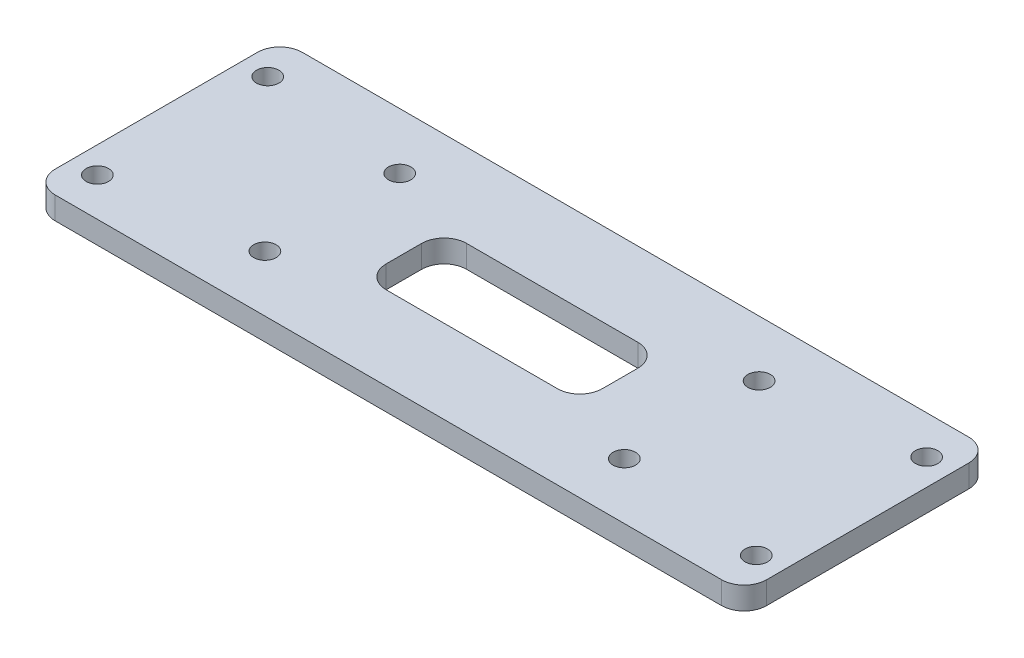
ISO-10303-21;
HEADER;
FILE_DESCRIPTION(('STEP AP214'),'2;1');
FILE_NAME('part.step','',(''),(''),'','','');
FILE_SCHEMA(('AUTOMOTIVE_DESIGN { 1 0 10303 214 1 1 1 1 }'));
ENDSEC;
DATA;
#1=APPLICATION_CONTEXT('core data for automotive mechanical design processes');
#2=APPLICATION_PROTOCOL_DEFINITION('international standard','automotive_design',2000,#1);
#3=PRODUCT_CONTEXT('',#1,'mechanical');
#4=PRODUCT('Part','Part','',(#3));
#5=PRODUCT_RELATED_PRODUCT_CATEGORY('part','',(#4));
#6=PRODUCT_DEFINITION_FORMATION('','',#4);
#7=PRODUCT_DEFINITION_CONTEXT('part definition',#1,'design');
#8=PRODUCT_DEFINITION('design','',#6,#7);
#9=PRODUCT_DEFINITION_SHAPE('','',#8);
#10=(LENGTH_UNIT() NAMED_UNIT(*) SI_UNIT(.MILLI.,.METRE.));
#11=(NAMED_UNIT(*) PLANE_ANGLE_UNIT() SI_UNIT($,.RADIAN.));
#12=(NAMED_UNIT(*) SI_UNIT($,.STERADIAN.) SOLID_ANGLE_UNIT());
#13=UNCERTAINTY_MEASURE_WITH_UNIT(LENGTH_MEASURE(1.E-05),#10,'distance_accuracy_value','');
#14=(GEOMETRIC_REPRESENTATION_CONTEXT(3) GLOBAL_UNCERTAINTY_ASSIGNED_CONTEXT((#13)) GLOBAL_UNIT_ASSIGNED_CONTEXT((#10,
#11,#12)) REPRESENTATION_CONTEXT('',''));
#15=CARTESIAN_POINT('',(0.,0.,0.));
#16=DIRECTION('',(0.,0.,1.));
#17=DIRECTION('',(1.,0.,0.));
#18=AXIS2_PLACEMENT_3D('',#15,#16,#17);
#19=CARTESIAN_POINT('',(-47.5,3.,16.5));
#20=DIRECTION('',(1.,0.,0.));
#21=DIRECTION('',(0.,0.,-1.));
#22=AXIS2_PLACEMENT_3D('',#19,#20,#21);
#23=PLANE('',#22);
#24=DIRECTION('',(0.,0.,1.));
#25=VECTOR('',#24,1.);
#26=CARTESIAN_POINT('',(-47.5,0.,16.5));
#27=LINE('',#26,#25);
#28=CARTESIAN_POINT('',(-47.5,0.,-13.5));
#29=VERTEX_POINT('',#28);
#30=CARTESIAN_POINT('',(-47.5,0.,13.5));
#31=VERTEX_POINT('',#30);
#32=EDGE_CURVE('E322',#29,#31,#27,.T.);
#33=ORIENTED_EDGE('',*,*,#32,.T.);
#34=DIRECTION('',(0.,-1.,0.));
#35=VECTOR('',#34,1.);
#36=CARTESIAN_POINT('',(-47.5,3.,13.5));
#37=LINE('',#36,#35);
#38=CARTESIAN_POINT('',(-47.5,3.,13.5));
#39=VERTEX_POINT('',#38);
#40=EDGE_CURVE('E208',#31,#39,#37,.F.);
#41=ORIENTED_EDGE('',*,*,#40,.T.);
#42=DIRECTION('',(0.,0.,1.));
#43=VECTOR('',#42,1.);
#44=CARTESIAN_POINT('',(-47.5,3.,16.5));
#45=LINE('',#44,#43);
#46=CARTESIAN_POINT('',(-47.5,3.,-13.5));
#47=VERTEX_POINT('',#46);
#48=EDGE_CURVE('E174',#47,#39,#45,.T.);
#49=ORIENTED_EDGE('',*,*,#48,.F.);
#50=DIRECTION('',(0.,-1.,0.));
#51=VECTOR('',#50,1.);
#52=CARTESIAN_POINT('',(-47.5,3.,-13.5));
#53=LINE('',#52,#51);
#54=EDGE_CURVE('E205',#47,#29,#53,.T.);
#55=ORIENTED_EDGE('',*,*,#54,.T.);
#56=EDGE_LOOP('',(#33,#41,#49,#55));
#57=FACE_BOUND('',#56,.T.);
#58=ADVANCED_FACE('F35',(#57),#23,.F.);
#59=CARTESIAN_POINT('',(47.5,3.,16.5));
#60=DIRECTION('',(0.,0.,-1.));
#61=DIRECTION('',(-1.,0.,0.));
#62=AXIS2_PLACEMENT_3D('',#59,#60,#61);
#63=PLANE('',#62);
#64=DIRECTION('',(1.,0.,0.));
#65=VECTOR('',#64,1.);
#66=CARTESIAN_POINT('',(47.5,0.,16.5));
#67=LINE('',#66,#65);
#68=CARTESIAN_POINT('',(-44.5,0.,16.5));
#69=VERTEX_POINT('',#68);
#70=CARTESIAN_POINT('',(44.5,0.,16.5));
#71=VERTEX_POINT('',#70);
#72=EDGE_CURVE('E180',#69,#71,#67,.T.);
#73=ORIENTED_EDGE('',*,*,#72,.T.);
#74=DIRECTION('',(0.,-1.,0.));
#75=VECTOR('',#74,1.);
#76=CARTESIAN_POINT('',(44.5,3.,16.5));
#77=LINE('',#76,#75);
#78=CARTESIAN_POINT('',(44.5,3.,16.5));
#79=VERTEX_POINT('',#78);
#80=EDGE_CURVE('E203',#71,#79,#77,.F.);
#81=ORIENTED_EDGE('',*,*,#80,.T.);
#82=DIRECTION('',(1.,0.,0.));
#83=VECTOR('',#82,1.);
#84=CARTESIAN_POINT('',(47.5,3.,16.5));
#85=LINE('',#84,#83);
#86=CARTESIAN_POINT('',(-44.5,3.,16.5));
#87=VERTEX_POINT('',#86);
#88=EDGE_CURVE('E178',#87,#79,#85,.T.);
#89=ORIENTED_EDGE('',*,*,#88,.F.);
#90=DIRECTION('',(0.,-1.,0.));
#91=VECTOR('',#90,1.);
#92=CARTESIAN_POINT('',(-44.5,3.,16.5));
#93=LINE('',#92,#91);
#94=EDGE_CURVE('E200',#87,#69,#93,.T.);
#95=ORIENTED_EDGE('',*,*,#94,.T.);
#96=EDGE_LOOP('',(#73,#81,#89,#95));
#97=FACE_BOUND('',#96,.T.);
#98=ADVANCED_FACE('F336',(#97),#63,.F.);
#99=CARTESIAN_POINT('',(47.5,3.,16.5));
#100=DIRECTION('',(-1.,0.,0.));
#101=DIRECTION('',(0.,0.,1.));
#102=AXIS2_PLACEMENT_3D('',#99,#100,#101);
#103=PLANE('',#102);
#104=DIRECTION('',(0.,0.,-1.));
#105=VECTOR('',#104,1.);
#106=CARTESIAN_POINT('',(47.5,0.,16.5));
#107=LINE('',#106,#105);
#108=CARTESIAN_POINT('',(47.5,0.,13.5));
#109=VERTEX_POINT('',#108);
#110=CARTESIAN_POINT('',(47.5,0.,-13.5));
#111=VERTEX_POINT('',#110);
#112=EDGE_CURVE('E175',#109,#111,#107,.T.);
#113=ORIENTED_EDGE('',*,*,#112,.T.);
#114=DIRECTION('',(0.,-1.,0.));
#115=VECTOR('',#114,1.);
#116=CARTESIAN_POINT('',(47.5,3.,-13.5));
#117=LINE('',#116,#115);
#118=CARTESIAN_POINT('',(47.5,3.,-13.5));
#119=VERTEX_POINT('',#118);
#120=EDGE_CURVE('E153',#111,#119,#117,.F.);
#121=ORIENTED_EDGE('',*,*,#120,.T.);
#122=DIRECTION('',(0.,0.,-1.));
#123=VECTOR('',#122,1.);
#124=CARTESIAN_POINT('',(47.5,3.,16.5));
#125=LINE('',#124,#123);
#126=CARTESIAN_POINT('',(47.5,3.,13.5));
#127=VERTEX_POINT('',#126);
#128=EDGE_CURVE('E327',#127,#119,#125,.T.);
#129=ORIENTED_EDGE('',*,*,#128,.F.);
#130=DIRECTION('',(0.,-1.,0.));
#131=VECTOR('',#130,1.);
#132=CARTESIAN_POINT('',(47.5,3.,13.5));
#133=LINE('',#132,#131);
#134=EDGE_CURVE('E158',#127,#109,#133,.T.);
#135=ORIENTED_EDGE('',*,*,#134,.T.);
#136=EDGE_LOOP('',(#113,#121,#129,#135));
#137=FACE_BOUND('',#136,.T.);
#138=ADVANCED_FACE('F346',(#137),#103,.F.);
#139=CARTESIAN_POINT('',(47.5,3.,-16.5));
#140=DIRECTION('',(0.,0.,1.));
#141=DIRECTION('',(1.,0.,0.));
#142=AXIS2_PLACEMENT_3D('',#139,#140,#141);
#143=PLANE('',#142);
#144=DIRECTION('',(-1.,0.,0.));
#145=VECTOR('',#144,1.);
#146=CARTESIAN_POINT('',(47.5,3.,-16.5));
#147=LINE('',#146,#145);
#148=CARTESIAN_POINT('',(44.5,3.,-16.5));
#149=VERTEX_POINT('',#148);
#150=CARTESIAN_POINT('',(-44.5,3.,-16.5));
#151=VERTEX_POINT('',#150);
#152=EDGE_CURVE('E168',#149,#151,#147,.T.);
#153=ORIENTED_EDGE('',*,*,#152,.F.);
#154=DIRECTION('',(0.,-1.,0.));
#155=VECTOR('',#154,1.);
#156=CARTESIAN_POINT('',(44.5,3.,-16.5));
#157=LINE('',#156,#155);
#158=CARTESIAN_POINT('',(44.5,0.,-16.5));
#159=VERTEX_POINT('',#158);
#160=EDGE_CURVE('E152',#149,#159,#157,.T.);
#161=ORIENTED_EDGE('',*,*,#160,.T.);
#162=DIRECTION('',(-1.,0.,0.));
#163=VECTOR('',#162,1.);
#164=CARTESIAN_POINT('',(47.5,0.,-16.5));
#165=LINE('',#164,#163);
#166=CARTESIAN_POINT('',(-44.5,0.,-16.5));
#167=VERTEX_POINT('',#166);
#168=EDGE_CURVE('E165',#159,#167,#165,.T.);
#169=ORIENTED_EDGE('',*,*,#168,.T.);
#170=DIRECTION('',(0.,-1.,0.));
#171=VECTOR('',#170,1.);
#172=CARTESIAN_POINT('',(-44.5,3.,-16.5));
#173=LINE('',#172,#171);
#174=EDGE_CURVE('E170',#167,#151,#173,.F.);
#175=ORIENTED_EDGE('',*,*,#174,.T.);
#176=EDGE_LOOP('',(#153,#161,#169,#175));
#177=FACE_BOUND('',#176,.T.);
#178=ADVANCED_FACE('F164',(#177),#143,.F.);
#179=CARTESIAN_POINT('',(0.,3.,0.));
#180=DIRECTION('',(0.,1.,0.));
#181=DIRECTION('',(0.,0.,1.));
#182=AXIS2_PLACEMENT_3D('',#179,#180,#181);
#183=PLANE('',#182);
#184=DIRECTION('',(0.,0.,1.));
#185=VECTOR('',#184,1.);
#186=CARTESIAN_POINT('',(-14.4362430611693,3.,5.36929549718934));
#187=LINE('',#186,#185);
#188=CARTESIAN_POINT('',(-14.4362430611693,3.,-2.36929549718934));
#189=VERTEX_POINT('',#188);
#190=CARTESIAN_POINT('',(-14.4362430611693,3.,2.36929549718934));
#191=VERTEX_POINT('',#190);
#192=EDGE_CURVE('E247',#189,#191,#187,.T.);
#193=ORIENTED_EDGE('',*,*,#192,.F.);
#194=CARTESIAN_POINT('',(-11.4362430611693,3.,-2.36929549718934));
#195=DIRECTION('',(0.,1.,0.));
#196=DIRECTION('',(0.,0.,1.));
#197=AXIS2_PLACEMENT_3D('',#194,#195,#196);
#198=CIRCLE('',#197,3.);
#199=CARTESIAN_POINT('',(-11.4362430611693,3.,-5.36929549718934));
#200=VERTEX_POINT('',#199);
#201=EDGE_CURVE('E43',#189,#200,#198,.F.);
#202=ORIENTED_EDGE('',*,*,#201,.T.);
#203=DIRECTION('',(-1.,0.,0.));
#204=VECTOR('',#203,1.);
#205=CARTESIAN_POINT('',(14.4362430611693,3.,-5.36929549718934));
#206=LINE('',#205,#204);
#207=CARTESIAN_POINT('',(11.4362430611693,3.,-5.36929549718934));
#208=VERTEX_POINT('',#207);
#209=EDGE_CURVE('E246',#208,#200,#206,.T.);
#210=ORIENTED_EDGE('',*,*,#209,.F.);
#211=CARTESIAN_POINT('',(11.4362430611693,3.,-2.36929549718934));
#212=DIRECTION('',(0.,1.,0.));
#213=DIRECTION('',(0.,0.,1.));
#214=AXIS2_PLACEMENT_3D('',#211,#212,#213);
#215=CIRCLE('',#214,3.);
#216=CARTESIAN_POINT('',(14.4362430611693,3.,-2.36929549718934));
#217=VERTEX_POINT('',#216);
#218=EDGE_CURVE('E233',#208,#217,#215,.F.);
#219=ORIENTED_EDGE('',*,*,#218,.T.);
#220=DIRECTION('',(0.,0.,-1.));
#221=VECTOR('',#220,1.);
#222=CARTESIAN_POINT('',(14.4362430611693,3.,5.36929549718934));
#223=LINE('',#222,#221);
#224=CARTESIAN_POINT('',(14.4362430611693,3.,2.36929549718934));
#225=VERTEX_POINT('',#224);
#226=EDGE_CURVE('E256',#225,#217,#223,.T.);
#227=ORIENTED_EDGE('',*,*,#226,.F.);
#228=CARTESIAN_POINT('',(11.4362430611693,3.,2.36929549718934));
#229=DIRECTION('',(0.,1.,0.));
#230=DIRECTION('',(0.,0.,1.));
#231=AXIS2_PLACEMENT_3D('',#228,#229,#230);
#232=CIRCLE('',#231,3.);
#233=CARTESIAN_POINT('',(11.4362430611693,3.,5.36929549718934));
#234=VERTEX_POINT('',#233);
#235=EDGE_CURVE('E229',#225,#234,#232,.F.);
#236=ORIENTED_EDGE('',*,*,#235,.T.);
#237=DIRECTION('',(1.,0.,0.));
#238=VECTOR('',#237,1.);
#239=CARTESIAN_POINT('',(14.4362430611693,3.,5.36929549718934));
#240=LINE('',#239,#238);
#241=CARTESIAN_POINT('',(-11.4362430611693,3.,5.36929549718934));
#242=VERTEX_POINT('',#241);
#243=EDGE_CURVE('E272',#242,#234,#240,.T.);
#244=ORIENTED_EDGE('',*,*,#243,.F.);
#245=CARTESIAN_POINT('',(-11.4362430611693,3.,2.36929549718934));
#246=DIRECTION('',(0.,1.,0.));
#247=DIRECTION('',(0.,0.,1.));
#248=AXIS2_PLACEMENT_3D('',#245,#246,#247);
#249=CIRCLE('',#248,3.);
#250=EDGE_CURVE('E237',#242,#191,#249,.F.);
#251=ORIENTED_EDGE('',*,*,#250,.T.);
#252=EDGE_LOOP('',(#193,#202,#210,#219,#227,#236,#244,#251));
#253=FACE_BOUND('',#252,.T.);
#254=CARTESIAN_POINT('',(24.,3.,-9.));
#255=DIRECTION('',(0.,1.,0.));
#256=DIRECTION('',(0.,0.,1.));
#257=AXIS2_PLACEMENT_3D('',#254,#255,#256);
#258=CIRCLE('',#257,1.5);
#259=CARTESIAN_POINT('',(24.,3.,-7.5));
#260=VERTEX_POINT('',#259);
#261=EDGE_CURVE('E287',#260,#260,#258,.T.);
#262=ORIENTED_EDGE('',*,*,#261,.F.);
#263=EDGE_LOOP('',(#262));
#264=FACE_BOUND('',#263,.T.);
#265=CARTESIAN_POINT('',(-24.,3.,9.));
#266=DIRECTION('',(0.,1.,0.));
#267=DIRECTION('',(0.,0.,1.));
#268=AXIS2_PLACEMENT_3D('',#265,#266,#267);
#269=CIRCLE('',#268,1.5);
#270=CARTESIAN_POINT('',(-24.,3.,10.5));
#271=VERTEX_POINT('',#270);
#272=EDGE_CURVE('E280',#271,#271,#269,.T.);
#273=ORIENTED_EDGE('',*,*,#272,.F.);
#274=EDGE_LOOP('',(#273));
#275=FACE_BOUND('',#274,.T.);
#276=CARTESIAN_POINT('',(24.,3.,8.99999999999999));
#277=DIRECTION('',(0.,1.,0.));
#278=DIRECTION('',(0.,0.,1.));
#279=AXIS2_PLACEMENT_3D('',#276,#277,#278);
#280=CIRCLE('',#279,1.5);
#281=CARTESIAN_POINT('',(24.,3.,10.5));
#282=VERTEX_POINT('',#281);
#283=EDGE_CURVE('E270',#282,#282,#280,.T.);
#284=ORIENTED_EDGE('',*,*,#283,.F.);
#285=EDGE_LOOP('',(#284));
#286=FACE_BOUND('',#285,.T.);
#287=CARTESIAN_POINT('',(-24.,3.,-9.));
#288=DIRECTION('',(0.,1.,0.));
#289=DIRECTION('',(0.,0.,1.));
#290=AXIS2_PLACEMENT_3D('',#287,#288,#289);
#291=CIRCLE('',#290,1.5);
#292=CARTESIAN_POINT('',(-24.,3.,-7.5));
#293=VERTEX_POINT('',#292);
#294=EDGE_CURVE('E286',#293,#293,#291,.T.);
#295=ORIENTED_EDGE('',*,*,#294,.F.);
#296=EDGE_LOOP('',(#295));
#297=FACE_BOUND('',#296,.T.);
#298=CARTESIAN_POINT('',(44.,3.,-11.375));
#299=DIRECTION('',(0.,1.,0.));
#300=DIRECTION('',(0.,0.,1.));
#301=AXIS2_PLACEMENT_3D('',#298,#299,#300);
#302=CIRCLE('',#301,1.5);
#303=CARTESIAN_POINT('',(44.,3.,-9.875));
#304=VERTEX_POINT('',#303);
#305=EDGE_CURVE('E298',#304,#304,#302,.T.);
#306=ORIENTED_EDGE('',*,*,#305,.F.);
#307=EDGE_LOOP('',(#306));
#308=FACE_BOUND('',#307,.T.);
#309=CARTESIAN_POINT('',(44.,3.,11.375));
#310=DIRECTION('',(0.,1.,0.));
#311=DIRECTION('',(0.,0.,1.));
#312=AXIS2_PLACEMENT_3D('',#309,#310,#311);
#313=CIRCLE('',#312,1.5);
#314=CARTESIAN_POINT('',(44.,3.,12.875));
#315=VERTEX_POINT('',#314);
#316=EDGE_CURVE('E311',#315,#315,#313,.T.);
#317=ORIENTED_EDGE('',*,*,#316,.F.);
#318=EDGE_LOOP('',(#317));
#319=FACE_BOUND('',#318,.T.);
#320=CARTESIAN_POINT('',(-44.,3.,11.375));
#321=DIRECTION('',(0.,1.,0.));
#322=DIRECTION('',(0.,0.,1.));
#323=AXIS2_PLACEMENT_3D('',#320,#321,#322);
#324=CIRCLE('',#323,1.5);
#325=CARTESIAN_POINT('',(-44.,3.,12.875));
#326=VERTEX_POINT('',#325);
#327=EDGE_CURVE('E305',#326,#326,#324,.T.);
#328=ORIENTED_EDGE('',*,*,#327,.F.);
#329=EDGE_LOOP('',(#328));
#330=FACE_BOUND('',#329,.T.);
#331=CARTESIAN_POINT('',(-44.,3.,-11.375));
#332=DIRECTION('',(0.,1.,0.));
#333=DIRECTION('',(0.,0.,1.));
#334=AXIS2_PLACEMENT_3D('',#331,#332,#333);
#335=CIRCLE('',#334,1.5);
#336=CARTESIAN_POINT('',(-44.,3.,-9.87499999999999));
#337=VERTEX_POINT('',#336);
#338=EDGE_CURVE('E304',#337,#337,#335,.T.);
#339=ORIENTED_EDGE('',*,*,#338,.F.);
#340=EDGE_LOOP('',(#339));
#341=FACE_BOUND('',#340,.T.);
#342=ORIENTED_EDGE('',*,*,#128,.T.);
#343=CARTESIAN_POINT('',(44.5,3.,-13.5));
#344=DIRECTION('',(0.,1.,0.));
#345=DIRECTION('',(0.,0.,1.));
#346=AXIS2_PLACEMENT_3D('',#343,#344,#345);
#347=CIRCLE('',#346,3.);
#348=EDGE_CURVE('E198',#119,#149,#347,.T.);
#349=ORIENTED_EDGE('',*,*,#348,.T.);
#350=ORIENTED_EDGE('',*,*,#152,.T.);
#351=CARTESIAN_POINT('',(-44.5,3.,-13.5));
#352=DIRECTION('',(0.,1.,0.));
#353=DIRECTION('',(0.,0.,1.));
#354=AXIS2_PLACEMENT_3D('',#351,#352,#353);
#355=CIRCLE('',#354,3.);
#356=EDGE_CURVE('E192',#151,#47,#355,.T.);
#357=ORIENTED_EDGE('',*,*,#356,.T.);
#358=ORIENTED_EDGE('',*,*,#48,.T.);
#359=CARTESIAN_POINT('',(-44.5,3.,13.5));
#360=DIRECTION('',(0.,1.,0.));
#361=DIRECTION('',(0.,0.,1.));
#362=AXIS2_PLACEMENT_3D('',#359,#360,#361);
#363=CIRCLE('',#362,3.);
#364=EDGE_CURVE('E194',#39,#87,#363,.T.);
#365=ORIENTED_EDGE('',*,*,#364,.T.);
#366=ORIENTED_EDGE('',*,*,#88,.T.);
#367=CARTESIAN_POINT('',(44.5,3.,13.5));
#368=DIRECTION('',(0.,1.,0.));
#369=DIRECTION('',(0.,0.,1.));
#370=AXIS2_PLACEMENT_3D('',#367,#368,#369);
#371=CIRCLE('',#370,3.);
#372=EDGE_CURVE('E196',#79,#127,#371,.T.);
#373=ORIENTED_EDGE('',*,*,#372,.T.);
#374=EDGE_LOOP('',(#342,#349,#350,#357,#358,#365,#366,#373));
#375=FACE_BOUND('',#374,.T.);
#376=ADVANCED_FACE('F244',(#253,#264,#275,#286,#297,#308,#319,#330,#341,#375),#183,.T.);
#377=CARTESIAN_POINT('',(0.,0.,0.));
#378=DIRECTION('',(0.,1.,0.));
#379=DIRECTION('',(0.,0.,1.));
#380=AXIS2_PLACEMENT_3D('',#377,#378,#379);
#381=PLANE('',#380);
#382=DIRECTION('',(0.,0.,-1.));
#383=VECTOR('',#382,1.);
#384=CARTESIAN_POINT('',(14.4362430611693,0.,5.36929549718934));
#385=LINE('',#384,#383);
#386=CARTESIAN_POINT('',(14.4362430611693,0.,2.36929549718934));
#387=VERTEX_POINT('',#386);
#388=CARTESIAN_POINT('',(14.4362430611693,0.,-2.36929549718934));
#389=VERTEX_POINT('',#388);
#390=EDGE_CURVE('E263',#387,#389,#385,.T.);
#391=ORIENTED_EDGE('',*,*,#390,.T.);
#392=CARTESIAN_POINT('',(11.4362430611693,0.,-2.36929549718934));
#393=DIRECTION('',(0.,1.,0.));
#394=DIRECTION('',(0.,0.,1.));
#395=AXIS2_PLACEMENT_3D('',#392,#393,#394);
#396=CIRCLE('',#395,3.);
#397=CARTESIAN_POINT('',(11.4362430611693,0.,-5.36929549718934));
#398=VERTEX_POINT('',#397);
#399=EDGE_CURVE('E235',#389,#398,#396,.T.);
#400=ORIENTED_EDGE('',*,*,#399,.T.);
#401=DIRECTION('',(-1.,0.,0.));
#402=VECTOR('',#401,1.);
#403=CARTESIAN_POINT('',(14.4362430611693,0.,-5.36929549718934));
#404=LINE('',#403,#402);
#405=CARTESIAN_POINT('',(-11.4362430611693,0.,-5.36929549718934));
#406=VERTEX_POINT('',#405);
#407=EDGE_CURVE('E268',#398,#406,#404,.T.);
#408=ORIENTED_EDGE('',*,*,#407,.T.);
#409=CARTESIAN_POINT('',(-11.4362430611693,0.,-2.36929549718934));
#410=DIRECTION('',(0.,1.,0.));
#411=DIRECTION('',(0.,0.,1.));
#412=AXIS2_PLACEMENT_3D('',#409,#410,#411);
#413=CIRCLE('',#412,3.);
#414=CARTESIAN_POINT('',(-14.4362430611693,0.,-2.36929549718934));
#415=VERTEX_POINT('',#414);
#416=EDGE_CURVE('E11',#406,#415,#413,.T.);
#417=ORIENTED_EDGE('',*,*,#416,.T.);
#418=DIRECTION('',(0.,0.,1.));
#419=VECTOR('',#418,1.);
#420=CARTESIAN_POINT('',(-14.4362430611693,0.,5.36929549718934));
#421=LINE('',#420,#419);
#422=CARTESIAN_POINT('',(-14.4362430611693,0.,2.36929549718934));
#423=VERTEX_POINT('',#422);
#424=EDGE_CURVE('E255',#415,#423,#421,.T.);
#425=ORIENTED_EDGE('',*,*,#424,.T.);
#426=CARTESIAN_POINT('',(-11.4362430611693,0.,2.36929549718934));
#427=DIRECTION('',(0.,1.,0.));
#428=DIRECTION('',(0.,0.,1.));
#429=AXIS2_PLACEMENT_3D('',#426,#427,#428);
#430=CIRCLE('',#429,3.);
#431=CARTESIAN_POINT('',(-11.4362430611693,0.,5.36929549718934));
#432=VERTEX_POINT('',#431);
#433=EDGE_CURVE('E239',#423,#432,#430,.T.);
#434=ORIENTED_EDGE('',*,*,#433,.T.);
#435=DIRECTION('',(1.,0.,0.));
#436=VECTOR('',#435,1.);
#437=CARTESIAN_POINT('',(14.4362430611693,0.,5.36929549718934));
#438=LINE('',#437,#436);
#439=CARTESIAN_POINT('',(11.4362430611693,0.,5.36929549718934));
#440=VERTEX_POINT('',#439);
#441=EDGE_CURVE('E260',#432,#440,#438,.T.);
#442=ORIENTED_EDGE('',*,*,#441,.T.);
#443=CARTESIAN_POINT('',(11.4362430611693,0.,2.36929549718934));
#444=DIRECTION('',(0.,1.,0.));
#445=DIRECTION('',(0.,0.,1.));
#446=AXIS2_PLACEMENT_3D('',#443,#444,#445);
#447=CIRCLE('',#446,3.);
#448=EDGE_CURVE('E231',#440,#387,#447,.T.);
#449=ORIENTED_EDGE('',*,*,#448,.T.);
#450=EDGE_LOOP('',(#391,#400,#408,#417,#425,#434,#442,#449));
#451=FACE_BOUND('',#450,.T.);
#452=CARTESIAN_POINT('',(24.,0.,-9.));
#453=DIRECTION('',(0.,1.,0.));
#454=DIRECTION('',(0.,0.,1.));
#455=AXIS2_PLACEMENT_3D('',#452,#453,#454);
#456=CIRCLE('',#455,1.5);
#457=CARTESIAN_POINT('',(24.,0.,-7.5));
#458=VERTEX_POINT('',#457);
#459=EDGE_CURVE('E283',#458,#458,#456,.T.);
#460=ORIENTED_EDGE('',*,*,#459,.T.);
#461=EDGE_LOOP('',(#460));
#462=FACE_BOUND('',#461,.T.);
#463=CARTESIAN_POINT('',(-24.,0.,9.));
#464=DIRECTION('',(0.,1.,0.));
#465=DIRECTION('',(0.,0.,1.));
#466=AXIS2_PLACEMENT_3D('',#463,#464,#465);
#467=CIRCLE('',#466,1.5);
#468=CARTESIAN_POINT('',(-24.,0.,10.5));
#469=VERTEX_POINT('',#468);
#470=EDGE_CURVE('E290',#469,#469,#467,.T.);
#471=ORIENTED_EDGE('',*,*,#470,.T.);
#472=EDGE_LOOP('',(#471));
#473=FACE_BOUND('',#472,.T.);
#474=CARTESIAN_POINT('',(24.,0.,8.99999999999999));
#475=DIRECTION('',(0.,1.,0.));
#476=DIRECTION('',(0.,0.,1.));
#477=AXIS2_PLACEMENT_3D('',#474,#475,#476);
#478=CIRCLE('',#477,1.5);
#479=CARTESIAN_POINT('',(24.,0.,10.5));
#480=VERTEX_POINT('',#479);
#481=EDGE_CURVE('E277',#480,#480,#478,.T.);
#482=ORIENTED_EDGE('',*,*,#481,.T.);
#483=EDGE_LOOP('',(#482));
#484=FACE_BOUND('',#483,.T.);
#485=CARTESIAN_POINT('',(-24.,0.,-9.));
#486=DIRECTION('',(0.,1.,0.));
#487=DIRECTION('',(0.,0.,1.));
#488=AXIS2_PLACEMENT_3D('',#485,#486,#487);
#489=CIRCLE('',#488,1.5);
#490=CARTESIAN_POINT('',(-24.,0.,-7.5));
#491=VERTEX_POINT('',#490);
#492=EDGE_CURVE('E295',#491,#491,#489,.T.);
#493=ORIENTED_EDGE('',*,*,#492,.T.);
#494=EDGE_LOOP('',(#493));
#495=FACE_BOUND('',#494,.T.);
#496=CARTESIAN_POINT('',(44.,0.,-11.375));
#497=DIRECTION('',(0.,1.,0.));
#498=DIRECTION('',(0.,0.,1.));
#499=AXIS2_PLACEMENT_3D('',#496,#497,#498);
#500=CIRCLE('',#499,1.5);
#501=CARTESIAN_POINT('',(44.,0.,-9.875));
#502=VERTEX_POINT('',#501);
#503=EDGE_CURVE('E314',#502,#502,#500,.T.);
#504=ORIENTED_EDGE('',*,*,#503,.T.);
#505=EDGE_LOOP('',(#504));
#506=FACE_BOUND('',#505,.T.);
#507=CARTESIAN_POINT('',(44.,0.,11.375));
#508=DIRECTION('',(0.,1.,0.));
#509=DIRECTION('',(0.,0.,1.));
#510=AXIS2_PLACEMENT_3D('',#507,#508,#509);
#511=CIRCLE('',#510,1.5);
#512=CARTESIAN_POINT('',(44.,0.,12.875));
#513=VERTEX_POINT('',#512);
#514=EDGE_CURVE('E308',#513,#513,#511,.T.);
#515=ORIENTED_EDGE('',*,*,#514,.T.);
#516=EDGE_LOOP('',(#515));
#517=FACE_BOUND('',#516,.T.);
#518=CARTESIAN_POINT('',(-44.,0.,11.375));
#519=DIRECTION('',(0.,1.,0.));
#520=DIRECTION('',(0.,0.,1.));
#521=AXIS2_PLACEMENT_3D('',#518,#519,#520);
#522=CIRCLE('',#521,1.5);
#523=CARTESIAN_POINT('',(-44.,0.,12.875));
#524=VERTEX_POINT('',#523);
#525=EDGE_CURVE('E301',#524,#524,#522,.T.);
#526=ORIENTED_EDGE('',*,*,#525,.T.);
#527=EDGE_LOOP('',(#526));
#528=FACE_BOUND('',#527,.T.);
#529=CARTESIAN_POINT('',(-44.,0.,-11.375));
#530=DIRECTION('',(0.,1.,0.));
#531=DIRECTION('',(0.,0.,1.));
#532=AXIS2_PLACEMENT_3D('',#529,#530,#531);
#533=CIRCLE('',#532,1.5);
#534=CARTESIAN_POINT('',(-44.,0.,-9.87499999999999));
#535=VERTEX_POINT('',#534);
#536=EDGE_CURVE('E319',#535,#535,#533,.T.);
#537=ORIENTED_EDGE('',*,*,#536,.T.);
#538=EDGE_LOOP('',(#537));
#539=FACE_BOUND('',#538,.T.);
#540=ORIENTED_EDGE('',*,*,#168,.F.);
#541=CARTESIAN_POINT('',(44.5,0.,-13.5));
#542=DIRECTION('',(0.,1.,0.));
#543=DIRECTION('',(0.,0.,1.));
#544=AXIS2_PLACEMENT_3D('',#541,#542,#543);
#545=CIRCLE('',#544,3.);
#546=EDGE_CURVE('E148',#159,#111,#545,.F.);
#547=ORIENTED_EDGE('',*,*,#546,.T.);
#548=ORIENTED_EDGE('',*,*,#112,.F.);
#549=CARTESIAN_POINT('',(44.5,0.,13.5));
#550=DIRECTION('',(0.,1.,0.));
#551=DIRECTION('',(0.,0.,1.));
#552=AXIS2_PLACEMENT_3D('',#549,#550,#551);
#553=CIRCLE('',#552,3.);
#554=EDGE_CURVE('E159',#109,#71,#553,.F.);
#555=ORIENTED_EDGE('',*,*,#554,.T.);
#556=ORIENTED_EDGE('',*,*,#72,.F.);
#557=CARTESIAN_POINT('',(-44.5,0.,13.5));
#558=DIRECTION('',(0.,1.,0.));
#559=DIRECTION('',(0.,0.,1.));
#560=AXIS2_PLACEMENT_3D('',#557,#558,#559);
#561=CIRCLE('',#560,3.);
#562=EDGE_CURVE('E186',#69,#31,#561,.F.);
#563=ORIENTED_EDGE('',*,*,#562,.T.);
#564=ORIENTED_EDGE('',*,*,#32,.F.);
#565=CARTESIAN_POINT('',(-44.5,0.,-13.5));
#566=DIRECTION('',(0.,1.,0.));
#567=DIRECTION('',(0.,0.,1.));
#568=AXIS2_PLACEMENT_3D('',#565,#566,#567);
#569=CIRCLE('',#568,3.);
#570=EDGE_CURVE('E169',#29,#167,#569,.F.);
#571=ORIENTED_EDGE('',*,*,#570,.T.);
#572=EDGE_LOOP('',(#540,#547,#548,#555,#556,#563,#564,#571));
#573=FACE_BOUND('',#572,.T.);
#574=ADVANCED_FACE('F172',(#451,#462,#473,#484,#495,#506,#517,#528,#539,#573),#381,.F.);
#575=CARTESIAN_POINT('',(-44.,0.,-11.375));
#576=DIRECTION('',(0.,1.,0.));
#577=DIRECTION('',(0.,0.,1.));
#578=AXIS2_PLACEMENT_3D('',#575,#576,#577);
#579=CYLINDRICAL_SURFACE('',#578,1.5);
#580=ORIENTED_EDGE('',*,*,#536,.F.);
#581=EDGE_LOOP('',(#580));
#582=FACE_BOUND('',#581,.T.);
#583=ORIENTED_EDGE('',*,*,#338,.T.);
#584=EDGE_LOOP('',(#583));
#585=FACE_BOUND('',#584,.T.);
#586=ADVANCED_FACE('F433',(#582,#585),#579,.F.);
#587=CARTESIAN_POINT('',(-44.,0.,11.375));
#588=DIRECTION('',(0.,1.,0.));
#589=DIRECTION('',(0.,0.,1.));
#590=AXIS2_PLACEMENT_3D('',#587,#588,#589);
#591=CYLINDRICAL_SURFACE('',#590,1.5);
#592=ORIENTED_EDGE('',*,*,#525,.F.);
#593=EDGE_LOOP('',(#592));
#594=FACE_BOUND('',#593,.T.);
#595=ORIENTED_EDGE('',*,*,#327,.T.);
#596=EDGE_LOOP('',(#595));
#597=FACE_BOUND('',#596,.T.);
#598=ADVANCED_FACE('F429',(#594,#597),#591,.F.);
#599=CARTESIAN_POINT('',(44.,0.,11.375));
#600=DIRECTION('',(0.,1.,0.));
#601=DIRECTION('',(0.,0.,1.));
#602=AXIS2_PLACEMENT_3D('',#599,#600,#601);
#603=CYLINDRICAL_SURFACE('',#602,1.5);
#604=ORIENTED_EDGE('',*,*,#514,.F.);
#605=EDGE_LOOP('',(#604));
#606=FACE_BOUND('',#605,.T.);
#607=ORIENTED_EDGE('',*,*,#316,.T.);
#608=EDGE_LOOP('',(#607));
#609=FACE_BOUND('',#608,.T.);
#610=ADVANCED_FACE('F432',(#606,#609),#603,.F.);
#611=CARTESIAN_POINT('',(44.,0.,-11.375));
#612=DIRECTION('',(0.,1.,0.));
#613=DIRECTION('',(0.,0.,1.));
#614=AXIS2_PLACEMENT_3D('',#611,#612,#613);
#615=CYLINDRICAL_SURFACE('',#614,1.5);
#616=ORIENTED_EDGE('',*,*,#503,.F.);
#617=EDGE_LOOP('',(#616));
#618=FACE_BOUND('',#617,.T.);
#619=ORIENTED_EDGE('',*,*,#305,.T.);
#620=EDGE_LOOP('',(#619));
#621=FACE_BOUND('',#620,.T.);
#622=ADVANCED_FACE('F427',(#618,#621),#615,.F.);
#623=CARTESIAN_POINT('',(-24.,0.,-9.));
#624=DIRECTION('',(0.,1.,0.));
#625=DIRECTION('',(0.,0.,1.));
#626=AXIS2_PLACEMENT_3D('',#623,#624,#625);
#627=CYLINDRICAL_SURFACE('',#626,1.5);
#628=ORIENTED_EDGE('',*,*,#492,.F.);
#629=EDGE_LOOP('',(#628));
#630=FACE_BOUND('',#629,.T.);
#631=ORIENTED_EDGE('',*,*,#294,.T.);
#632=EDGE_LOOP('',(#631));
#633=FACE_BOUND('',#632,.T.);
#634=ADVANCED_FACE('F417',(#630,#633),#627,.F.);
#635=CARTESIAN_POINT('',(24.,0.,8.99999999999999));
#636=DIRECTION('',(0.,1.,0.));
#637=DIRECTION('',(0.,0.,1.));
#638=AXIS2_PLACEMENT_3D('',#635,#636,#637);
#639=CYLINDRICAL_SURFACE('',#638,1.5);
#640=ORIENTED_EDGE('',*,*,#481,.F.);
#641=EDGE_LOOP('',(#640));
#642=FACE_BOUND('',#641,.T.);
#643=ORIENTED_EDGE('',*,*,#283,.T.);
#644=EDGE_LOOP('',(#643));
#645=FACE_BOUND('',#644,.T.);
#646=ADVANCED_FACE('F413',(#642,#645),#639,.F.);
#647=CARTESIAN_POINT('',(-24.,0.,9.));
#648=DIRECTION('',(0.,1.,0.));
#649=DIRECTION('',(0.,0.,1.));
#650=AXIS2_PLACEMENT_3D('',#647,#648,#649);
#651=CYLINDRICAL_SURFACE('',#650,1.5);
#652=ORIENTED_EDGE('',*,*,#470,.F.);
#653=EDGE_LOOP('',(#652));
#654=FACE_BOUND('',#653,.T.);
#655=ORIENTED_EDGE('',*,*,#272,.T.);
#656=EDGE_LOOP('',(#655));
#657=FACE_BOUND('',#656,.T.);
#658=ADVANCED_FACE('F416',(#654,#657),#651,.F.);
#659=CARTESIAN_POINT('',(24.,0.,-9.));
#660=DIRECTION('',(0.,1.,0.));
#661=DIRECTION('',(0.,0.,1.));
#662=AXIS2_PLACEMENT_3D('',#659,#660,#661);
#663=CYLINDRICAL_SURFACE('',#662,1.5);
#664=ORIENTED_EDGE('',*,*,#459,.F.);
#665=EDGE_LOOP('',(#664));
#666=FACE_BOUND('',#665,.T.);
#667=ORIENTED_EDGE('',*,*,#261,.T.);
#668=EDGE_LOOP('',(#667));
#669=FACE_BOUND('',#668,.T.);
#670=ADVANCED_FACE('F363',(#666,#669),#663,.F.);
#671=CARTESIAN_POINT('',(44.5,3.,-13.5));
#672=DIRECTION('',(0.,-1.,0.));
#673=DIRECTION('',(0.,0.,-1.));
#674=AXIS2_PLACEMENT_3D('',#671,#672,#673);
#675=CYLINDRICAL_SURFACE('',#674,3.);
#676=ORIENTED_EDGE('',*,*,#348,.F.);
#677=ORIENTED_EDGE('',*,*,#120,.F.);
#678=ORIENTED_EDGE('',*,*,#546,.F.);
#679=ORIENTED_EDGE('',*,*,#160,.F.);
#680=EDGE_LOOP('',(#676,#677,#678,#679));
#681=FACE_BOUND('',#680,.T.);
#682=ADVANCED_FACE('F151',(#681),#675,.T.);
#683=CARTESIAN_POINT('',(44.5,3.,13.5));
#684=DIRECTION('',(0.,-1.,0.));
#685=DIRECTION('',(0.,0.,-1.));
#686=AXIS2_PLACEMENT_3D('',#683,#684,#685);
#687=CYLINDRICAL_SURFACE('',#686,3.);
#688=ORIENTED_EDGE('',*,*,#372,.F.);
#689=ORIENTED_EDGE('',*,*,#80,.F.);
#690=ORIENTED_EDGE('',*,*,#554,.F.);
#691=ORIENTED_EDGE('',*,*,#134,.F.);
#692=EDGE_LOOP('',(#688,#689,#690,#691));
#693=FACE_BOUND('',#692,.T.);
#694=ADVANCED_FACE('F341',(#693),#687,.T.);
#695=CARTESIAN_POINT('',(-44.5,3.,13.5));
#696=DIRECTION('',(0.,-1.,0.));
#697=DIRECTION('',(0.,0.,-1.));
#698=AXIS2_PLACEMENT_3D('',#695,#696,#697);
#699=CYLINDRICAL_SURFACE('',#698,3.);
#700=ORIENTED_EDGE('',*,*,#364,.F.);
#701=ORIENTED_EDGE('',*,*,#40,.F.);
#702=ORIENTED_EDGE('',*,*,#562,.F.);
#703=ORIENTED_EDGE('',*,*,#94,.F.);
#704=EDGE_LOOP('',(#700,#701,#702,#703));
#705=FACE_BOUND('',#704,.T.);
#706=ADVANCED_FACE('F366',(#705),#699,.T.);
#707=CARTESIAN_POINT('',(-44.5,3.,-13.5));
#708=DIRECTION('',(0.,-1.,0.));
#709=DIRECTION('',(0.,0.,-1.));
#710=AXIS2_PLACEMENT_3D('',#707,#708,#709);
#711=CYLINDRICAL_SURFACE('',#710,3.);
#712=ORIENTED_EDGE('',*,*,#356,.F.);
#713=ORIENTED_EDGE('',*,*,#174,.F.);
#714=ORIENTED_EDGE('',*,*,#570,.F.);
#715=ORIENTED_EDGE('',*,*,#54,.F.);
#716=EDGE_LOOP('',(#712,#713,#714,#715));
#717=FACE_BOUND('',#716,.T.);
#718=ADVANCED_FACE('F369',(#717),#711,.T.);
#719=CARTESIAN_POINT('',(-14.4362430611693,0.,5.36929549718934));
#720=DIRECTION('',(-1.,0.,0.));
#721=DIRECTION('',(0.,0.,1.));
#722=AXIS2_PLACEMENT_3D('',#719,#720,#721);
#723=PLANE('',#722);
#724=ORIENTED_EDGE('',*,*,#192,.T.);
#725=DIRECTION('',(0.,1.,0.));
#726=VECTOR('',#725,1.);
#727=CARTESIAN_POINT('',(-14.4362430611693,0.,2.36929549718934));
#728=LINE('',#727,#726);
#729=EDGE_CURVE('E50',#191,#423,#728,.F.);
#730=ORIENTED_EDGE('',*,*,#729,.T.);
#731=ORIENTED_EDGE('',*,*,#424,.F.);
#732=DIRECTION('',(0.,1.,0.));
#733=VECTOR('',#732,1.);
#734=CARTESIAN_POINT('',(-14.4362430611693,3.,-2.36929549718934));
#735=LINE('',#734,#733);
#736=EDGE_CURVE('E225',#415,#189,#735,.T.);
#737=ORIENTED_EDGE('',*,*,#736,.T.);
#738=EDGE_LOOP('',(#724,#730,#731,#737));
#739=FACE_BOUND('',#738,.T.);
#740=ADVANCED_FACE('F258',(#739),#723,.F.);
#741=CARTESIAN_POINT('',(14.4362430611693,0.,-5.36929549718934));
#742=DIRECTION('',(0.,0.,-1.));
#743=DIRECTION('',(-1.,0.,0.));
#744=AXIS2_PLACEMENT_3D('',#741,#742,#743);
#745=PLANE('',#744);
#746=ORIENTED_EDGE('',*,*,#407,.F.);
#747=DIRECTION('',(0.,1.,0.));
#748=VECTOR('',#747,1.);
#749=CARTESIAN_POINT('',(11.4362430611693,3.,-5.36929549718934));
#750=LINE('',#749,#748);
#751=EDGE_CURVE('E222',#398,#208,#750,.T.);
#752=ORIENTED_EDGE('',*,*,#751,.T.);
#753=ORIENTED_EDGE('',*,*,#209,.T.);
#754=DIRECTION('',(0.,1.,0.));
#755=VECTOR('',#754,1.);
#756=CARTESIAN_POINT('',(-11.4362430611693,0.,-5.36929549718934));
#757=LINE('',#756,#755);
#758=EDGE_CURVE('E220',#200,#406,#757,.F.);
#759=ORIENTED_EDGE('',*,*,#758,.T.);
#760=EDGE_LOOP('',(#746,#752,#753,#759));
#761=FACE_BOUND('',#760,.T.);
#762=ADVANCED_FACE('F253',(#761),#745,.F.);
#763=CARTESIAN_POINT('',(14.4362430611693,0.,5.36929549718934));
#764=DIRECTION('',(1.,0.,0.));
#765=DIRECTION('',(0.,0.,-1.));
#766=AXIS2_PLACEMENT_3D('',#763,#764,#765);
#767=PLANE('',#766);
#768=ORIENTED_EDGE('',*,*,#390,.F.);
#769=DIRECTION('',(0.,1.,0.));
#770=VECTOR('',#769,1.);
#771=CARTESIAN_POINT('',(14.4362430611693,3.,2.36929549718934));
#772=LINE('',#771,#770);
#773=EDGE_CURVE('E212',#387,#225,#772,.T.);
#774=ORIENTED_EDGE('',*,*,#773,.T.);
#775=ORIENTED_EDGE('',*,*,#226,.T.);
#776=DIRECTION('',(0.,1.,0.));
#777=VECTOR('',#776,1.);
#778=CARTESIAN_POINT('',(14.4362430611693,0.,-2.36929549718934));
#779=LINE('',#778,#777);
#780=EDGE_CURVE('E210',#217,#389,#779,.F.);
#781=ORIENTED_EDGE('',*,*,#780,.T.);
#782=EDGE_LOOP('',(#768,#774,#775,#781));
#783=FACE_BOUND('',#782,.T.);
#784=ADVANCED_FACE('F399',(#783),#767,.F.);
#785=CARTESIAN_POINT('',(14.4362430611693,0.,5.36929549718934));
#786=DIRECTION('',(0.,0.,1.));
#787=DIRECTION('',(1.,0.,0.));
#788=AXIS2_PLACEMENT_3D('',#785,#786,#787);
#789=PLANE('',#788);
#790=ORIENTED_EDGE('',*,*,#243,.T.);
#791=DIRECTION('',(0.,1.,0.));
#792=VECTOR('',#791,1.);
#793=CARTESIAN_POINT('',(11.4362430611693,0.,5.36929549718934));
#794=LINE('',#793,#792);
#795=EDGE_CURVE('E218',#234,#440,#794,.F.);
#796=ORIENTED_EDGE('',*,*,#795,.T.);
#797=ORIENTED_EDGE('',*,*,#441,.F.);
#798=DIRECTION('',(0.,1.,0.));
#799=VECTOR('',#798,1.);
#800=CARTESIAN_POINT('',(-11.4362430611693,3.,5.36929549718934));
#801=LINE('',#800,#799);
#802=EDGE_CURVE('E215',#432,#242,#801,.T.);
#803=ORIENTED_EDGE('',*,*,#802,.T.);
#804=EDGE_LOOP('',(#790,#796,#797,#803));
#805=FACE_BOUND('',#804,.T.);
#806=ADVANCED_FACE('F378',(#805),#789,.F.);
#807=CARTESIAN_POINT('',(11.4362430611693,0.,2.36929549718934));
#808=DIRECTION('',(0.,-1.,0.));
#809=DIRECTION('',(0.,0.,-1.));
#810=AXIS2_PLACEMENT_3D('',#807,#808,#809);
#811=CYLINDRICAL_SURFACE('',#810,3.);
#812=ORIENTED_EDGE('',*,*,#448,.F.);
#813=ORIENTED_EDGE('',*,*,#795,.F.);
#814=ORIENTED_EDGE('',*,*,#235,.F.);
#815=ORIENTED_EDGE('',*,*,#773,.F.);
#816=EDGE_LOOP('',(#812,#813,#814,#815));
#817=FACE_BOUND('',#816,.T.);
#818=ADVANCED_FACE('F374',(#817),#811,.F.);
#819=CARTESIAN_POINT('',(11.4362430611693,0.,-2.36929549718934));
#820=DIRECTION('',(0.,-1.,0.));
#821=DIRECTION('',(0.,0.,-1.));
#822=AXIS2_PLACEMENT_3D('',#819,#820,#821);
#823=CYLINDRICAL_SURFACE('',#822,3.);
#824=ORIENTED_EDGE('',*,*,#399,.F.);
#825=ORIENTED_EDGE('',*,*,#780,.F.);
#826=ORIENTED_EDGE('',*,*,#218,.F.);
#827=ORIENTED_EDGE('',*,*,#751,.F.);
#828=EDGE_LOOP('',(#824,#825,#826,#827));
#829=FACE_BOUND('',#828,.T.);
#830=ADVANCED_FACE('F377',(#829),#823,.F.);
#831=CARTESIAN_POINT('',(-11.4362430611693,0.,2.36929549718934));
#832=DIRECTION('',(0.,-1.,0.));
#833=DIRECTION('',(0.,0.,-1.));
#834=AXIS2_PLACEMENT_3D('',#831,#832,#833);
#835=CYLINDRICAL_SURFACE('',#834,3.);
#836=ORIENTED_EDGE('',*,*,#433,.F.);
#837=ORIENTED_EDGE('',*,*,#729,.F.);
#838=ORIENTED_EDGE('',*,*,#250,.F.);
#839=ORIENTED_EDGE('',*,*,#802,.F.);
#840=EDGE_LOOP('',(#836,#837,#838,#839));
#841=FACE_BOUND('',#840,.T.);
#842=ADVANCED_FACE('F381',(#841),#835,.F.);
#843=CARTESIAN_POINT('',(-11.4362430611693,0.,-2.36929549718934));
#844=DIRECTION('',(0.,-1.,0.));
#845=DIRECTION('',(0.,0.,-1.));
#846=AXIS2_PLACEMENT_3D('',#843,#844,#845);
#847=CYLINDRICAL_SURFACE('',#846,3.);
#848=ORIENTED_EDGE('',*,*,#416,.F.);
#849=ORIENTED_EDGE('',*,*,#758,.F.);
#850=ORIENTED_EDGE('',*,*,#201,.F.);
#851=ORIENTED_EDGE('',*,*,#736,.F.);
#852=EDGE_LOOP('',(#848,#849,#850,#851));
#853=FACE_BOUND('',#852,.T.);
#854=ADVANCED_FACE('F37',(#853),#847,.F.);
#855=CLOSED_SHELL('',(#58,#98,#138,#178,#376,#574,#586,#598,#610,#622,#634,#646,#658,#670,#682,
#694,#706,#718,#740,#762,#784,#806,#818,#830,#842,#854));
#856=MANIFOLD_SOLID_BREP('B2',#855);
#857=ADVANCED_BREP_SHAPE_REPRESENTATION('',(#18,#856),#14);
#858=SHAPE_DEFINITION_REPRESENTATION(#9,#857);
ENDSEC;
END-ISO-10303-21;
